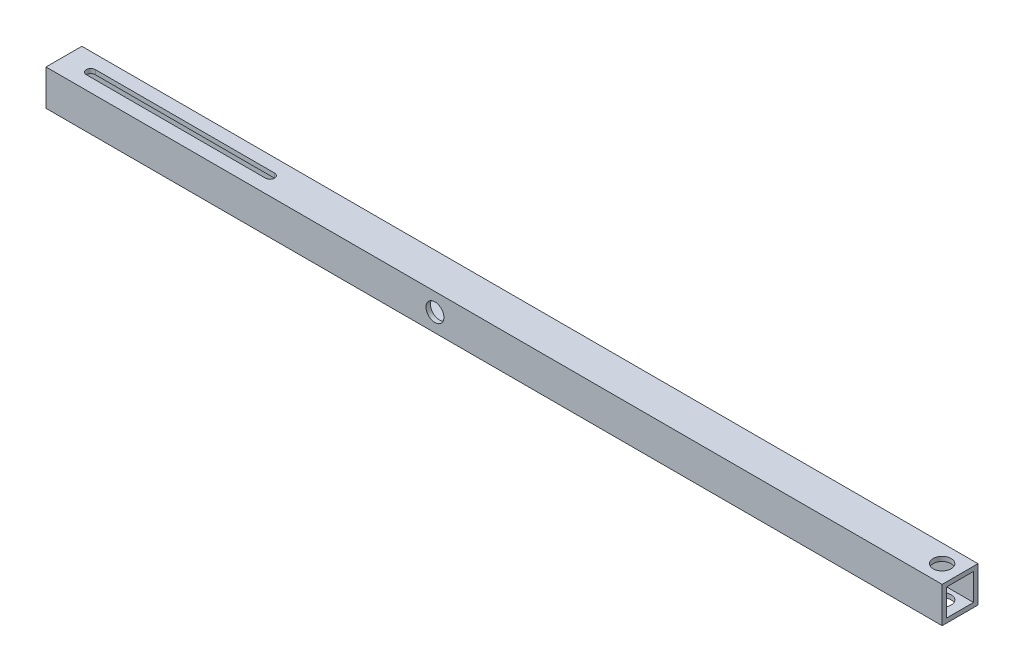
ISO-10303-21;
HEADER;
FILE_DESCRIPTION(('STEP AP214'),'2;1');
FILE_NAME('part.step','',(''),(''),'','','');
FILE_SCHEMA(('AUTOMOTIVE_DESIGN { 1 0 10303 214 1 1 1 1 }'));
ENDSEC;
DATA;
#1=APPLICATION_CONTEXT('core data for automotive mechanical design processes');
#2=APPLICATION_PROTOCOL_DEFINITION('international standard','automotive_design',2000,#1);
#3=PRODUCT_CONTEXT('',#1,'mechanical');
#4=PRODUCT('Part','Part','',(#3));
#5=PRODUCT_RELATED_PRODUCT_CATEGORY('part','',(#4));
#6=PRODUCT_DEFINITION_FORMATION('','',#4);
#7=PRODUCT_DEFINITION_CONTEXT('part definition',#1,'design');
#8=PRODUCT_DEFINITION('design','',#6,#7);
#9=PRODUCT_DEFINITION_SHAPE('','',#8);
#10=(LENGTH_UNIT() NAMED_UNIT(*) SI_UNIT(.MILLI.,.METRE.));
#11=(NAMED_UNIT(*) PLANE_ANGLE_UNIT() SI_UNIT($,.RADIAN.));
#12=(NAMED_UNIT(*) SI_UNIT($,.STERADIAN.) SOLID_ANGLE_UNIT());
#13=UNCERTAINTY_MEASURE_WITH_UNIT(LENGTH_MEASURE(1.E-05),#10,'distance_accuracy_value','');
#14=(GEOMETRIC_REPRESENTATION_CONTEXT(3) GLOBAL_UNCERTAINTY_ASSIGNED_CONTEXT((#13)) GLOBAL_UNIT_ASSIGNED_CONTEXT((#10,
#11,#12)) REPRESENTATION_CONTEXT('',''));
#15=CARTESIAN_POINT('',(0.,0.,0.));
#16=DIRECTION('',(0.,0.,1.));
#17=DIRECTION('',(1.,0.,0.));
#18=AXIS2_PLACEMENT_3D('',#15,#16,#17);
#19=CARTESIAN_POINT('',(250.,2.5,-7.5));
#20=DIRECTION('',(0.,0.,-1.));
#21=DIRECTION('',(0.,1.,0.));
#22=AXIS2_PLACEMENT_3D('',#19,#20,#21);
#23=PLANE('',#22);
#24=CARTESIAN_POINT('',(-32.9999999999999,10.,-7.5));
#25=DIRECTION('',(0.,0.,-1.));
#26=DIRECTION('',(0.,1.,0.));
#27=AXIS2_PLACEMENT_3D('',#24,#25,#26);
#28=CIRCLE('',#27,5.);
#29=CARTESIAN_POINT('',(-32.9999999999999,15.,-7.5));
#30=VERTEX_POINT('',#29);
#31=EDGE_CURVE('E295',#30,#30,#28,.F.);
#32=ORIENTED_EDGE('',*,*,#31,.F.);
#33=EDGE_LOOP('',(#32));
#34=FACE_BOUND('',#33,.T.);
#35=DIRECTION('',(0.,1.,0.));
#36=VECTOR('',#35,1.);
#37=CARTESIAN_POINT('',(-115.747808126116,2.5,-7.5));
#38=LINE('',#37,#36);
#39=CARTESIAN_POINT('',(-115.747808126116,2.5,-7.5));
#40=VERTEX_POINT('',#39);
#41=CARTESIAN_POINT('',(-115.747808126116,16.4021270674297,-7.5));
#42=VERTEX_POINT('',#41);
#43=EDGE_CURVE('E12',#40,#42,#38,.T.);
#44=ORIENTED_EDGE('',*,*,#43,.F.);
#45=DIRECTION('',(-1.,0.,0.));
#46=VECTOR('',#45,1.);
#47=CARTESIAN_POINT('',(250.,2.5,-7.5));
#48=LINE('',#47,#46);
#49=CARTESIAN_POINT('',(250.,2.5,-7.5));
#50=VERTEX_POINT('',#49);
#51=EDGE_CURVE('E352',#50,#40,#48,.T.);
#52=ORIENTED_EDGE('',*,*,#51,.F.);
#53=DIRECTION('',(0.,-1.,0.));
#54=VECTOR('',#53,1.);
#55=CARTESIAN_POINT('',(250.,2.5,-7.5));
#56=LINE('',#55,#54);
#57=CARTESIAN_POINT('',(250.,17.5,-7.5));
#58=VERTEX_POINT('',#57);
#59=EDGE_CURVE('E251',#58,#50,#56,.T.);
#60=ORIENTED_EDGE('',*,*,#59,.F.);
#61=DIRECTION('',(-1.,0.,0.));
#62=VECTOR('',#61,1.);
#63=CARTESIAN_POINT('',(250.,17.5,-7.5));
#64=LINE('',#63,#62);
#65=CARTESIAN_POINT('',(-250.,17.5,-7.5));
#66=VERTEX_POINT('',#65);
#67=EDGE_CURVE('E337',#58,#66,#64,.T.);
#68=ORIENTED_EDGE('',*,*,#67,.T.);
#69=DIRECTION('',(0.,-1.,0.));
#70=VECTOR('',#69,1.);
#71=CARTESIAN_POINT('',(-250.,2.5,-7.5));
#72=LINE('',#71,#70);
#73=CARTESIAN_POINT('',(-250.,16.4021270674297,-7.5));
#74=VERTEX_POINT('',#73);
#75=EDGE_CURVE('E267',#66,#74,#72,.T.);
#76=ORIENTED_EDGE('',*,*,#75,.T.);
#77=DIRECTION('',(-1.,0.,0.));
#78=VECTOR('',#77,1.);
#79=CARTESIAN_POINT('',(250.,16.4021270674297,-7.5));
#80=LINE('',#79,#78);
#81=EDGE_CURVE('E57',#42,#74,#80,.T.);
#82=ORIENTED_EDGE('',*,*,#81,.F.);
#83=EDGE_LOOP('',(#44,#52,#60,#68,#76,#82));
#84=FACE_BOUND('',#83,.T.);
#85=ADVANCED_FACE('F48',(#34,#84),#23,.F.);
#86=CARTESIAN_POINT('',(-32.9999999999999,10.,-10.));
#87=DIRECTION('',(0.,0.,1.));
#88=DIRECTION('',(1.,0.,0.));
#89=AXIS2_PLACEMENT_3D('',#86,#87,#88);
#90=CYLINDRICAL_SURFACE('',#89,5.);
#91=CARTESIAN_POINT('',(-32.9999999999999,10.,7.5));
#92=DIRECTION('',(0.,0.,1.));
#93=DIRECTION('',(0.,-1.,0.));
#94=AXIS2_PLACEMENT_3D('',#91,#92,#93);
#95=CIRCLE('',#94,5.);
#96=CARTESIAN_POINT('',(-32.9999999999999,5.,7.5));
#97=VERTEX_POINT('',#96);
#98=EDGE_CURVE('E299',#97,#97,#95,.F.);
#99=ORIENTED_EDGE('',*,*,#98,.T.);
#100=EDGE_LOOP('',(#99));
#101=FACE_BOUND('',#100,.T.);
#102=CARTESIAN_POINT('',(-32.9999999999999,10.,10.));
#103=DIRECTION('',(0.,0.,1.));
#104=DIRECTION('',(1.,0.,0.));
#105=AXIS2_PLACEMENT_3D('',#102,#103,#104);
#106=CIRCLE('',#105,5.);
#107=CARTESIAN_POINT('',(-27.9999999999999,10.,10.));
#108=VERTEX_POINT('',#107);
#109=EDGE_CURVE('E304',#108,#108,#106,.T.);
#110=ORIENTED_EDGE('',*,*,#109,.T.);
#111=EDGE_LOOP('',(#110));
#112=FACE_BOUND('',#111,.T.);
#113=ADVANCED_FACE('F460',(#101,#112),#90,.F.);
#114=CARTESIAN_POINT('',(250.,20.,10.));
#115=DIRECTION('',(-1.,0.,0.));
#116=DIRECTION('',(0.,0.,1.));
#117=AXIS2_PLACEMENT_3D('',#114,#115,#116);
#118=PLANE('',#117);
#119=DIRECTION('',(0.,0.,1.));
#120=VECTOR('',#119,1.);
#121=CARTESIAN_POINT('',(250.,2.5,-7.5));
#122=LINE('',#121,#120);
#123=CARTESIAN_POINT('',(250.,2.5,7.5));
#124=VERTEX_POINT('',#123);
#125=EDGE_CURVE('E255',#50,#124,#122,.T.);
#126=ORIENTED_EDGE('',*,*,#125,.T.);
#127=DIRECTION('',(0.,1.,0.));
#128=VECTOR('',#127,1.);
#129=CARTESIAN_POINT('',(250.,2.5,7.5));
#130=LINE('',#129,#128);
#131=CARTESIAN_POINT('',(250.,17.5,7.5));
#132=VERTEX_POINT('',#131);
#133=EDGE_CURVE('E242',#124,#132,#130,.T.);
#134=ORIENTED_EDGE('',*,*,#133,.T.);
#135=DIRECTION('',(0.,0.,-1.));
#136=VECTOR('',#135,1.);
#137=CARTESIAN_POINT('',(250.,17.5,-7.5));
#138=LINE('',#137,#136);
#139=EDGE_CURVE('E246',#132,#58,#138,.T.);
#140=ORIENTED_EDGE('',*,*,#139,.T.);
#141=ORIENTED_EDGE('',*,*,#59,.T.);
#142=EDGE_LOOP('',(#126,#134,#140,#141));
#143=FACE_BOUND('',#142,.T.);
#144=DIRECTION('',(0.,0.,-1.));
#145=VECTOR('',#144,1.);
#146=CARTESIAN_POINT('',(250.,0.,10.));
#147=LINE('',#146,#145);
#148=CARTESIAN_POINT('',(250.,0.,10.));
#149=VERTEX_POINT('',#148);
#150=CARTESIAN_POINT('',(250.,0.,-10.));
#151=VERTEX_POINT('',#150);
#152=EDGE_CURVE('E390',#149,#151,#147,.T.);
#153=ORIENTED_EDGE('',*,*,#152,.T.);
#154=DIRECTION('',(0.,-1.,0.));
#155=VECTOR('',#154,1.);
#156=CARTESIAN_POINT('',(250.,20.,-10.));
#157=LINE('',#156,#155);
#158=CARTESIAN_POINT('',(250.,20.,-10.));
#159=VERTEX_POINT('',#158);
#160=EDGE_CURVE('E288',#159,#151,#157,.T.);
#161=ORIENTED_EDGE('',*,*,#160,.F.);
#162=DIRECTION('',(0.,0.,-1.));
#163=VECTOR('',#162,1.);
#164=CARTESIAN_POINT('',(250.,20.,10.));
#165=LINE('',#164,#163);
#166=CARTESIAN_POINT('',(250.,20.,10.));
#167=VERTEX_POINT('',#166);
#168=EDGE_CURVE('E415',#167,#159,#165,.T.);
#169=ORIENTED_EDGE('',*,*,#168,.F.);
#170=DIRECTION('',(0.,-1.,0.));
#171=VECTOR('',#170,1.);
#172=CARTESIAN_POINT('',(250.,20.,10.));
#173=LINE('',#172,#171);
#174=EDGE_CURVE('E416',#167,#149,#173,.T.);
#175=ORIENTED_EDGE('',*,*,#174,.T.);
#176=EDGE_LOOP('',(#153,#161,#169,#175));
#177=FACE_BOUND('',#176,.T.);
#178=ADVANCED_FACE('F50',(#143,#177),#118,.F.);
#179=CARTESIAN_POINT('',(-250.,20.,-10.));
#180=DIRECTION('',(0.,0.,1.));
#181=DIRECTION('',(1.,0.,0.));
#182=AXIS2_PLACEMENT_3D('',#179,#180,#181);
#183=PLANE('',#182);
#184=CARTESIAN_POINT('',(-32.9999999999999,10.,-10.));
#185=DIRECTION('',(0.,0.,1.));
#186=DIRECTION('',(1.,0.,0.));
#187=AXIS2_PLACEMENT_3D('',#184,#185,#186);
#188=CIRCLE('',#187,5.);
#189=CARTESIAN_POINT('',(-27.9999999999999,10.,-10.));
#190=VERTEX_POINT('',#189);
#191=EDGE_CURVE('E398',#190,#190,#188,.T.);
#192=ORIENTED_EDGE('',*,*,#191,.T.);
#193=EDGE_LOOP('',(#192));
#194=FACE_BOUND('',#193,.T.);
#195=DIRECTION('',(-1.,0.,0.));
#196=VECTOR('',#195,1.);
#197=CARTESIAN_POINT('',(-250.,0.,-10.));
#198=LINE('',#197,#196);
#199=CARTESIAN_POINT('',(-250.,0.,-10.));
#200=VERTEX_POINT('',#199);
#201=EDGE_CURVE('E393',#151,#200,#198,.T.);
#202=ORIENTED_EDGE('',*,*,#201,.T.);
#203=DIRECTION('',(0.,-1.,0.));
#204=VECTOR('',#203,1.);
#205=CARTESIAN_POINT('',(-250.,20.,-10.));
#206=LINE('',#205,#204);
#207=CARTESIAN_POINT('',(-250.,20.,-10.));
#208=VERTEX_POINT('',#207);
#209=EDGE_CURVE('E282',#208,#200,#206,.T.);
#210=ORIENTED_EDGE('',*,*,#209,.F.);
#211=DIRECTION('',(-1.,0.,0.));
#212=VECTOR('',#211,1.);
#213=CARTESIAN_POINT('',(-250.,20.,-10.));
#214=LINE('',#213,#212);
#215=EDGE_CURVE('E430',#159,#208,#214,.T.);
#216=ORIENTED_EDGE('',*,*,#215,.F.);
#217=ORIENTED_EDGE('',*,*,#160,.T.);
#218=EDGE_LOOP('',(#202,#210,#216,#217));
#219=FACE_BOUND('',#218,.T.);
#220=ADVANCED_FACE('F448',(#194,#219),#183,.F.);
#221=CARTESIAN_POINT('',(-250.,20.,10.));
#222=DIRECTION('',(1.,0.,0.));
#223=DIRECTION('',(0.,0.,-1.));
#224=AXIS2_PLACEMENT_3D('',#221,#222,#223);
#225=PLANE('',#224);
#226=DIRECTION('',(0.,0.,-1.));
#227=VECTOR('',#226,1.);
#228=CARTESIAN_POINT('',(-250.,17.5,-7.5));
#229=LINE('',#228,#227);
#230=CARTESIAN_POINT('',(-250.,17.5,7.5));
#231=VERTEX_POINT('',#230);
#232=EDGE_CURVE('E262',#231,#66,#229,.T.);
#233=ORIENTED_EDGE('',*,*,#232,.F.);
#234=DIRECTION('',(0.,1.,0.));
#235=VECTOR('',#234,1.);
#236=CARTESIAN_POINT('',(-250.,2.5,7.5));
#237=LINE('',#236,#235);
#238=CARTESIAN_POINT('',(-250.,2.5,7.5));
#239=VERTEX_POINT('',#238);
#240=EDGE_CURVE('E241',#239,#231,#237,.T.);
#241=ORIENTED_EDGE('',*,*,#240,.F.);
#242=DIRECTION('',(0.,0.,1.));
#243=VECTOR('',#242,1.);
#244=CARTESIAN_POINT('',(-250.,2.5,-7.5));
#245=LINE('',#244,#243);
#246=CARTESIAN_POINT('',(-250.,2.5,-7.5));
#247=VERTEX_POINT('',#246);
#248=EDGE_CURVE('E247',#247,#239,#245,.T.);
#249=ORIENTED_EDGE('',*,*,#248,.F.);
#250=EDGE_CURVE('E266',#74,#247,#72,.T.);
#251=ORIENTED_EDGE('',*,*,#250,.F.);
#252=ORIENTED_EDGE('',*,*,#75,.F.);
#253=EDGE_LOOP('',(#233,#241,#249,#251,#252));
#254=FACE_BOUND('',#253,.T.);
#255=DIRECTION('',(0.,0.,1.));
#256=VECTOR('',#255,1.);
#257=CARTESIAN_POINT('',(-250.,0.,10.));
#258=LINE('',#257,#256);
#259=CARTESIAN_POINT('',(-250.,0.,10.));
#260=VERTEX_POINT('',#259);
#261=EDGE_CURVE('E402',#200,#260,#258,.T.);
#262=ORIENTED_EDGE('',*,*,#261,.T.);
#263=DIRECTION('',(0.,-1.,0.));
#264=VECTOR('',#263,1.);
#265=CARTESIAN_POINT('',(-250.,20.,10.));
#266=LINE('',#265,#264);
#267=CARTESIAN_POINT('',(-250.,20.,10.));
#268=VERTEX_POINT('',#267);
#269=EDGE_CURVE('E289',#268,#260,#266,.T.);
#270=ORIENTED_EDGE('',*,*,#269,.F.);
#271=DIRECTION('',(0.,0.,1.));
#272=VECTOR('',#271,1.);
#273=CARTESIAN_POINT('',(-250.,20.,10.));
#274=LINE('',#273,#272);
#275=EDGE_CURVE('E433',#208,#268,#274,.T.);
#276=ORIENTED_EDGE('',*,*,#275,.F.);
#277=ORIENTED_EDGE('',*,*,#209,.T.);
#278=EDGE_LOOP('',(#262,#270,#276,#277));
#279=FACE_BOUND('',#278,.T.);
#280=ADVANCED_FACE('F331',(#254,#279),#225,.F.);
#281=CARTESIAN_POINT('',(-250.,20.,10.));
#282=DIRECTION('',(0.,0.,-1.));
#283=DIRECTION('',(-1.,0.,0.));
#284=AXIS2_PLACEMENT_3D('',#281,#282,#283);
#285=PLANE('',#284);
#286=ORIENTED_EDGE('',*,*,#109,.F.);
#287=EDGE_LOOP('',(#286));
#288=FACE_BOUND('',#287,.T.);
#289=DIRECTION('',(1.,0.,0.));
#290=VECTOR('',#289,1.);
#291=CARTESIAN_POINT('',(-250.,0.,10.));
#292=LINE('',#291,#290);
#293=EDGE_CURVE('E392',#260,#149,#292,.T.);
#294=ORIENTED_EDGE('',*,*,#293,.T.);
#295=ORIENTED_EDGE('',*,*,#174,.F.);
#296=DIRECTION('',(1.,0.,0.));
#297=VECTOR('',#296,1.);
#298=CARTESIAN_POINT('',(-250.,20.,10.));
#299=LINE('',#298,#297);
#300=EDGE_CURVE('E407',#268,#167,#299,.T.);
#301=ORIENTED_EDGE('',*,*,#300,.F.);
#302=ORIENTED_EDGE('',*,*,#269,.T.);
#303=EDGE_LOOP('',(#294,#295,#301,#302));
#304=FACE_BOUND('',#303,.T.);
#305=ADVANCED_FACE('F445',(#288,#304),#285,.F.);
#306=CARTESIAN_POINT('',(0.,20.,0.));
#307=DIRECTION('',(0.,-1.,0.));
#308=DIRECTION('',(0.,0.,-1.));
#309=AXIS2_PLACEMENT_3D('',#306,#307,#308);
#310=PLANE('',#309);
#311=CARTESIAN_POINT('',(240.,20.,0.));
#312=DIRECTION('',(0.,1.,0.));
#313=DIRECTION('',(0.,0.,1.));
#314=AXIS2_PLACEMENT_3D('',#311,#312,#313);
#315=CIRCLE('',#314,4.99999999999999);
#316=CARTESIAN_POINT('',(240.,20.,4.99999999999999));
#317=VERTEX_POINT('',#316);
#318=EDGE_CURVE('E501',#317,#317,#315,.T.);
#319=ORIENTED_EDGE('',*,*,#318,.F.);
#320=EDGE_LOOP('',(#319));
#321=FACE_BOUND('',#320,.T.);
#322=DIRECTION('',(1.,0.,0.));
#323=VECTOR('',#322,1.);
#324=CARTESIAN_POINT('',(-235.,20.,2.5));
#325=LINE('',#324,#323);
#326=CARTESIAN_POINT('',(-235.,20.,2.5));
#327=VERTEX_POINT('',#326);
#328=CARTESIAN_POINT('',(-135.,20.,2.5));
#329=VERTEX_POINT('',#328);
#330=EDGE_CURVE('E183',#327,#329,#325,.T.);
#331=ORIENTED_EDGE('',*,*,#330,.F.);
#332=CARTESIAN_POINT('',(-235.,20.,0.));
#333=DIRECTION('',(0.,1.,0.));
#334=DIRECTION('',(0.,0.,1.));
#335=AXIS2_PLACEMENT_3D('',#332,#333,#334);
#336=CIRCLE('',#335,2.5);
#337=CARTESIAN_POINT('',(-235.,20.,-2.5));
#338=VERTEX_POINT('',#337);
#339=EDGE_CURVE('E190',#338,#327,#336,.T.);
#340=ORIENTED_EDGE('',*,*,#339,.F.);
#341=DIRECTION('',(-1.,0.,0.));
#342=VECTOR('',#341,1.);
#343=CARTESIAN_POINT('',(-235.,20.,-2.5));
#344=LINE('',#343,#342);
#345=CARTESIAN_POINT('',(-135.,20.,-2.5));
#346=VERTEX_POINT('',#345);
#347=EDGE_CURVE('E194',#346,#338,#344,.T.);
#348=ORIENTED_EDGE('',*,*,#347,.F.);
#349=CARTESIAN_POINT('',(-135.,20.,0.));
#350=DIRECTION('',(0.,1.,0.));
#351=DIRECTION('',(0.,0.,1.));
#352=AXIS2_PLACEMENT_3D('',#349,#350,#351);
#353=CIRCLE('',#352,2.5);
#354=EDGE_CURVE('E171',#329,#346,#353,.T.);
#355=ORIENTED_EDGE('',*,*,#354,.F.);
#356=EDGE_LOOP('',(#331,#340,#348,#355));
#357=FACE_BOUND('',#356,.T.);
#358=ORIENTED_EDGE('',*,*,#168,.T.);
#359=ORIENTED_EDGE('',*,*,#215,.T.);
#360=ORIENTED_EDGE('',*,*,#275,.T.);
#361=ORIENTED_EDGE('',*,*,#300,.T.);
#362=EDGE_LOOP('',(#358,#359,#360,#361));
#363=FACE_BOUND('',#362,.T.);
#364=ADVANCED_FACE('F191',(#321,#357,#363),#310,.F.);
#365=CARTESIAN_POINT('',(0.,0.,0.));
#366=DIRECTION('',(0.,-1.,0.));
#367=DIRECTION('',(0.,0.,-1.));
#368=AXIS2_PLACEMENT_3D('',#365,#366,#367);
#369=PLANE('',#368);
#370=CARTESIAN_POINT('',(240.,0.,0.));
#371=DIRECTION('',(0.,1.,0.));
#372=DIRECTION('',(0.,0.,1.));
#373=AXIS2_PLACEMENT_3D('',#370,#371,#372);
#374=CIRCLE('',#373,4.99999999999999);
#375=CARTESIAN_POINT('',(240.,0.,4.99999999999999));
#376=VERTEX_POINT('',#375);
#377=EDGE_CURVE('E321',#376,#376,#374,.T.);
#378=ORIENTED_EDGE('',*,*,#377,.T.);
#379=EDGE_LOOP('',(#378));
#380=FACE_BOUND('',#379,.T.);
#381=CARTESIAN_POINT('',(-235.,0.,0.));
#382=DIRECTION('',(0.,-1.,0.));
#383=DIRECTION('',(0.,0.,-1.));
#384=AXIS2_PLACEMENT_3D('',#381,#382,#383);
#385=CIRCLE('',#384,2.5);
#386=CARTESIAN_POINT('',(-235.,0.,2.5));
#387=VERTEX_POINT('',#386);
#388=CARTESIAN_POINT('',(-235.,0.,-2.5));
#389=VERTEX_POINT('',#388);
#390=EDGE_CURVE('E238',#387,#389,#385,.T.);
#391=ORIENTED_EDGE('',*,*,#390,.F.);
#392=DIRECTION('',(-1.,0.,0.));
#393=VECTOR('',#392,1.);
#394=CARTESIAN_POINT('',(0.,0.,2.5));
#395=LINE('',#394,#393);
#396=CARTESIAN_POINT('',(-135.,0.,2.5));
#397=VERTEX_POINT('',#396);
#398=EDGE_CURVE('E216',#397,#387,#395,.T.);
#399=ORIENTED_EDGE('',*,*,#398,.F.);
#400=CARTESIAN_POINT('',(-135.,0.,0.));
#401=DIRECTION('',(0.,-1.,0.));
#402=DIRECTION('',(0.,0.,-1.));
#403=AXIS2_PLACEMENT_3D('',#400,#401,#402);
#404=CIRCLE('',#403,2.5);
#405=CARTESIAN_POINT('',(-135.,0.,-2.5));
#406=VERTEX_POINT('',#405);
#407=EDGE_CURVE('E223',#406,#397,#404,.T.);
#408=ORIENTED_EDGE('',*,*,#407,.F.);
#409=DIRECTION('',(1.,0.,0.));
#410=VECTOR('',#409,1.);
#411=CARTESIAN_POINT('',(0.,0.,-2.5));
#412=LINE('',#411,#410);
#413=EDGE_CURVE('E231',#389,#406,#412,.T.);
#414=ORIENTED_EDGE('',*,*,#413,.F.);
#415=EDGE_LOOP('',(#391,#399,#408,#414));
#416=FACE_BOUND('',#415,.T.);
#417=ORIENTED_EDGE('',*,*,#152,.F.);
#418=ORIENTED_EDGE('',*,*,#293,.F.);
#419=ORIENTED_EDGE('',*,*,#261,.F.);
#420=ORIENTED_EDGE('',*,*,#201,.F.);
#421=EDGE_LOOP('',(#417,#418,#419,#420));
#422=FACE_BOUND('',#421,.T.);
#423=ADVANCED_FACE('F381',(#380,#416,#422),#369,.T.);
#424=ORIENTED_EDGE('',*,*,#31,.T.);
#425=EDGE_LOOP('',(#424));
#426=FACE_BOUND('',#425,.T.);
#427=ORIENTED_EDGE('',*,*,#191,.F.);
#428=EDGE_LOOP('',(#427));
#429=FACE_BOUND('',#428,.T.);
#430=ADVANCED_FACE('F384',(#426,#429),#90,.F.);
#431=CARTESIAN_POINT('',(250.,2.5,7.5));
#432=DIRECTION('',(0.,0.,1.));
#433=DIRECTION('',(0.,-1.,0.));
#434=AXIS2_PLACEMENT_3D('',#431,#432,#433);
#435=PLANE('',#434);
#436=ORIENTED_EDGE('',*,*,#240,.T.);
#437=DIRECTION('',(-1.,0.,0.));
#438=VECTOR('',#437,1.);
#439=CARTESIAN_POINT('',(250.,17.5,7.5));
#440=LINE('',#439,#438);
#441=EDGE_CURVE('E259',#132,#231,#440,.T.);
#442=ORIENTED_EDGE('',*,*,#441,.F.);
#443=ORIENTED_EDGE('',*,*,#133,.F.);
#444=DIRECTION('',(-1.,0.,0.));
#445=VECTOR('',#444,1.);
#446=CARTESIAN_POINT('',(250.,2.5,7.5));
#447=LINE('',#446,#445);
#448=EDGE_CURVE('E300',#124,#239,#447,.T.);
#449=ORIENTED_EDGE('',*,*,#448,.T.);
#450=EDGE_LOOP('',(#436,#442,#443,#449));
#451=FACE_BOUND('',#450,.T.);
#452=ORIENTED_EDGE('',*,*,#98,.F.);
#453=EDGE_LOOP('',(#452));
#454=FACE_BOUND('',#453,.T.);
#455=ADVANCED_FACE('F346',(#451,#454),#435,.F.);
#456=EDGE_CURVE('E341',#40,#247,#48,.T.);
#457=ORIENTED_EDGE('',*,*,#456,.F.);
#458=ORIENTED_EDGE('',*,*,#43,.T.);
#459=ORIENTED_EDGE('',*,*,#81,.T.);
#460=ORIENTED_EDGE('',*,*,#250,.T.);
#461=EDGE_LOOP('',(#457,#458,#459,#460));
#462=FACE_BOUND('',#461,.T.);
#463=ADVANCED_FACE('F326',(#462),#23,.F.);
#464=CARTESIAN_POINT('',(250.,2.5,-7.5));
#465=DIRECTION('',(0.,-1.,0.));
#466=DIRECTION('',(0.,0.,-1.));
#467=AXIS2_PLACEMENT_3D('',#464,#465,#466);
#468=PLANE('',#467);
#469=CARTESIAN_POINT('',(240.,2.5,0.));
#470=DIRECTION('',(0.,-1.,0.));
#471=DIRECTION('',(0.,0.,-1.));
#472=AXIS2_PLACEMENT_3D('',#469,#470,#471);
#473=CIRCLE('',#472,4.99999999999999);
#474=CARTESIAN_POINT('',(240.,2.5,-4.99999999999999));
#475=VERTEX_POINT('',#474);
#476=EDGE_CURVE('E320',#475,#475,#473,.T.);
#477=ORIENTED_EDGE('',*,*,#476,.T.);
#478=EDGE_LOOP('',(#477));
#479=FACE_BOUND('',#478,.T.);
#480=DIRECTION('',(-1.,0.,0.));
#481=VECTOR('',#480,1.);
#482=CARTESIAN_POINT('',(250.,2.5,2.5));
#483=LINE('',#482,#481);
#484=CARTESIAN_POINT('',(-135.,2.5,2.5));
#485=VERTEX_POINT('',#484);
#486=CARTESIAN_POINT('',(-235.,2.5,2.5));
#487=VERTEX_POINT('',#486);
#488=EDGE_CURVE('E212',#485,#487,#483,.T.);
#489=ORIENTED_EDGE('',*,*,#488,.T.);
#490=CARTESIAN_POINT('',(-235.,2.5,0.));
#491=DIRECTION('',(0.,-1.,0.));
#492=DIRECTION('',(0.,0.,-1.));
#493=AXIS2_PLACEMENT_3D('',#490,#491,#492);
#494=CIRCLE('',#493,2.5);
#495=CARTESIAN_POINT('',(-235.,2.5,-2.5));
#496=VERTEX_POINT('',#495);
#497=EDGE_CURVE('E234',#487,#496,#494,.T.);
#498=ORIENTED_EDGE('',*,*,#497,.T.);
#499=DIRECTION('',(1.,0.,0.));
#500=VECTOR('',#499,1.);
#501=CARTESIAN_POINT('',(250.,2.5,-2.5));
#502=LINE('',#501,#500);
#503=CARTESIAN_POINT('',(-135.,2.5,-2.5));
#504=VERTEX_POINT('',#503);
#505=EDGE_CURVE('E227',#496,#504,#502,.T.);
#506=ORIENTED_EDGE('',*,*,#505,.T.);
#507=CARTESIAN_POINT('',(-135.,2.5,0.));
#508=DIRECTION('',(0.,-1.,0.));
#509=DIRECTION('',(0.,0.,-1.));
#510=AXIS2_PLACEMENT_3D('',#507,#508,#509);
#511=CIRCLE('',#510,2.5);
#512=EDGE_CURVE('E219',#504,#485,#511,.T.);
#513=ORIENTED_EDGE('',*,*,#512,.T.);
#514=EDGE_LOOP('',(#489,#498,#506,#513));
#515=FACE_BOUND('',#514,.T.);
#516=ORIENTED_EDGE('',*,*,#248,.T.);
#517=ORIENTED_EDGE('',*,*,#448,.F.);
#518=ORIENTED_EDGE('',*,*,#125,.F.);
#519=ORIENTED_EDGE('',*,*,#51,.T.);
#520=ORIENTED_EDGE('',*,*,#456,.T.);
#521=EDGE_LOOP('',(#516,#517,#518,#519,#520));
#522=FACE_BOUND('',#521,.T.);
#523=ADVANCED_FACE('F353',(#479,#515,#522),#468,.F.);
#524=CARTESIAN_POINT('',(250.,17.5,-7.5));
#525=DIRECTION('',(0.,1.,0.));
#526=DIRECTION('',(0.,0.,1.));
#527=AXIS2_PLACEMENT_3D('',#524,#525,#526);
#528=PLANE('',#527);
#529=CARTESIAN_POINT('',(240.,17.5,0.));
#530=DIRECTION('',(0.,1.,0.));
#531=DIRECTION('',(0.,0.,1.));
#532=AXIS2_PLACEMENT_3D('',#529,#530,#531);
#533=CIRCLE('',#532,4.99999999999999);
#534=CARTESIAN_POINT('',(240.,17.5,4.99999999999999));
#535=VERTEX_POINT('',#534);
#536=EDGE_CURVE('E317',#535,#535,#533,.T.);
#537=ORIENTED_EDGE('',*,*,#536,.T.);
#538=EDGE_LOOP('',(#537));
#539=FACE_BOUND('',#538,.T.);
#540=DIRECTION('',(-1.,0.,0.));
#541=VECTOR('',#540,1.);
#542=CARTESIAN_POINT('',(250.,17.5,-2.5));
#543=LINE('',#542,#541);
#544=CARTESIAN_POINT('',(-135.,17.5,-2.5));
#545=VERTEX_POINT('',#544);
#546=CARTESIAN_POINT('',(-235.,17.5,-2.5));
#547=VERTEX_POINT('',#546);
#548=EDGE_CURVE('E309',#545,#547,#543,.T.);
#549=ORIENTED_EDGE('',*,*,#548,.T.);
#550=CARTESIAN_POINT('',(-235.,17.5,0.));
#551=DIRECTION('',(0.,1.,0.));
#552=DIRECTION('',(0.,0.,1.));
#553=AXIS2_PLACEMENT_3D('',#550,#551,#552);
#554=CIRCLE('',#553,2.5);
#555=CARTESIAN_POINT('',(-235.,17.5,2.5));
#556=VERTEX_POINT('',#555);
#557=EDGE_CURVE('E313',#547,#556,#554,.T.);
#558=ORIENTED_EDGE('',*,*,#557,.T.);
#559=DIRECTION('',(1.,0.,0.));
#560=VECTOR('',#559,1.);
#561=CARTESIAN_POINT('',(250.,17.5,2.5));
#562=LINE('',#561,#560);
#563=CARTESIAN_POINT('',(-135.,17.5,2.5));
#564=VERTEX_POINT('',#563);
#565=EDGE_CURVE('E294',#556,#564,#562,.T.);
#566=ORIENTED_EDGE('',*,*,#565,.T.);
#567=CARTESIAN_POINT('',(-135.,17.5,0.));
#568=DIRECTION('',(0.,1.,0.));
#569=DIRECTION('',(0.,0.,1.));
#570=AXIS2_PLACEMENT_3D('',#567,#568,#569);
#571=CIRCLE('',#570,2.5);
#572=EDGE_CURVE('E174',#564,#545,#571,.T.);
#573=ORIENTED_EDGE('',*,*,#572,.T.);
#574=EDGE_LOOP('',(#549,#558,#566,#573));
#575=FACE_BOUND('',#574,.T.);
#576=ORIENTED_EDGE('',*,*,#232,.T.);
#577=ORIENTED_EDGE('',*,*,#67,.F.);
#578=ORIENTED_EDGE('',*,*,#139,.F.);
#579=ORIENTED_EDGE('',*,*,#441,.T.);
#580=EDGE_LOOP('',(#576,#577,#578,#579));
#581=FACE_BOUND('',#580,.T.);
#582=ADVANCED_FACE('F344',(#539,#575,#581),#528,.F.);
#583=CARTESIAN_POINT('',(-235.,-80.,2.5));
#584=DIRECTION('',(0.,0.,1.));
#585=DIRECTION('',(1.,0.,0.));
#586=AXIS2_PLACEMENT_3D('',#583,#584,#585);
#587=PLANE('',#586);
#588=DIRECTION('',(0.,1.,0.));
#589=VECTOR('',#588,1.);
#590=CARTESIAN_POINT('',(-235.,-80.,2.5));
#591=LINE('',#590,#589);
#592=EDGE_CURVE('E186',#556,#327,#591,.T.);
#593=ORIENTED_EDGE('',*,*,#592,.T.);
#594=ORIENTED_EDGE('',*,*,#330,.T.);
#595=DIRECTION('',(0.,1.,0.));
#596=VECTOR('',#595,1.);
#597=CARTESIAN_POINT('',(-135.,-80.,2.5));
#598=LINE('',#597,#596);
#599=EDGE_CURVE('E166',#564,#329,#598,.T.);
#600=ORIENTED_EDGE('',*,*,#599,.F.);
#601=ORIENTED_EDGE('',*,*,#565,.F.);
#602=EDGE_LOOP('',(#593,#594,#600,#601));
#603=FACE_BOUND('',#602,.T.);
#604=ADVANCED_FACE('F184',(#603),#587,.F.);
#605=CARTESIAN_POINT('',(-135.,-80.,0.));
#606=DIRECTION('',(0.,1.,0.));
#607=DIRECTION('',(0.,0.,1.));
#608=AXIS2_PLACEMENT_3D('',#605,#606,#607);
#609=CYLINDRICAL_SURFACE('',#608,2.5);
#610=ORIENTED_EDGE('',*,*,#599,.T.);
#611=ORIENTED_EDGE('',*,*,#354,.T.);
#612=DIRECTION('',(0.,1.,0.));
#613=VECTOR('',#612,1.);
#614=CARTESIAN_POINT('',(-135.,-80.,-2.5));
#615=LINE('',#614,#613);
#616=EDGE_CURVE('E207',#545,#346,#615,.T.);
#617=ORIENTED_EDGE('',*,*,#616,.F.);
#618=ORIENTED_EDGE('',*,*,#572,.F.);
#619=EDGE_LOOP('',(#610,#611,#617,#618));
#620=FACE_BOUND('',#619,.T.);
#621=ADVANCED_FACE('F168',(#620),#609,.F.);
#622=CARTESIAN_POINT('',(-235.,-80.,-2.5));
#623=DIRECTION('',(0.,0.,-1.));
#624=DIRECTION('',(-1.,0.,0.));
#625=AXIS2_PLACEMENT_3D('',#622,#623,#624);
#626=PLANE('',#625);
#627=ORIENTED_EDGE('',*,*,#616,.T.);
#628=ORIENTED_EDGE('',*,*,#347,.T.);
#629=DIRECTION('',(0.,1.,0.));
#630=VECTOR('',#629,1.);
#631=CARTESIAN_POINT('',(-235.,-80.,-2.5));
#632=LINE('',#631,#630);
#633=EDGE_CURVE('E202',#547,#338,#632,.T.);
#634=ORIENTED_EDGE('',*,*,#633,.F.);
#635=ORIENTED_EDGE('',*,*,#548,.F.);
#636=EDGE_LOOP('',(#627,#628,#634,#635));
#637=FACE_BOUND('',#636,.T.);
#638=ADVANCED_FACE('F493',(#637),#626,.F.);
#639=CARTESIAN_POINT('',(-235.,-80.,0.));
#640=DIRECTION('',(0.,1.,0.));
#641=DIRECTION('',(0.,0.,1.));
#642=AXIS2_PLACEMENT_3D('',#639,#640,#641);
#643=CYLINDRICAL_SURFACE('',#642,2.5);
#644=ORIENTED_EDGE('',*,*,#633,.T.);
#645=ORIENTED_EDGE('',*,*,#339,.T.);
#646=ORIENTED_EDGE('',*,*,#592,.F.);
#647=ORIENTED_EDGE('',*,*,#557,.F.);
#648=EDGE_LOOP('',(#644,#645,#646,#647));
#649=FACE_BOUND('',#648,.T.);
#650=ADVANCED_FACE('F495',(#649),#643,.F.);
#651=ORIENTED_EDGE('',*,*,#390,.T.);
#652=EDGE_CURVE('E205',#389,#496,#632,.T.);
#653=ORIENTED_EDGE('',*,*,#652,.T.);
#654=ORIENTED_EDGE('',*,*,#497,.F.);
#655=EDGE_CURVE('E179',#387,#487,#591,.T.);
#656=ORIENTED_EDGE('',*,*,#655,.F.);
#657=EDGE_LOOP('',(#651,#653,#654,#656));
#658=FACE_BOUND('',#657,.T.);
#659=ADVANCED_FACE('F370',(#658),#643,.F.);
#660=ORIENTED_EDGE('',*,*,#413,.T.);
#661=EDGE_CURVE('E206',#406,#504,#615,.T.);
#662=ORIENTED_EDGE('',*,*,#661,.T.);
#663=ORIENTED_EDGE('',*,*,#505,.F.);
#664=ORIENTED_EDGE('',*,*,#652,.F.);
#665=EDGE_LOOP('',(#660,#662,#663,#664));
#666=FACE_BOUND('',#665,.T.);
#667=ADVANCED_FACE('F378',(#666),#626,.F.);
#668=ORIENTED_EDGE('',*,*,#407,.T.);
#669=EDGE_CURVE('E178',#397,#485,#598,.T.);
#670=ORIENTED_EDGE('',*,*,#669,.T.);
#671=ORIENTED_EDGE('',*,*,#512,.F.);
#672=ORIENTED_EDGE('',*,*,#661,.F.);
#673=EDGE_LOOP('',(#668,#670,#671,#672));
#674=FACE_BOUND('',#673,.T.);
#675=ADVANCED_FACE('F375',(#674),#609,.F.);
#676=ORIENTED_EDGE('',*,*,#398,.T.);
#677=ORIENTED_EDGE('',*,*,#655,.T.);
#678=ORIENTED_EDGE('',*,*,#488,.F.);
#679=ORIENTED_EDGE('',*,*,#669,.F.);
#680=EDGE_LOOP('',(#676,#677,#678,#679));
#681=FACE_BOUND('',#680,.T.);
#682=ADVANCED_FACE('F366',(#681),#587,.F.);
#683=CARTESIAN_POINT('',(240.,0.,0.));
#684=DIRECTION('',(0.,1.,0.));
#685=DIRECTION('',(0.,0.,1.));
#686=AXIS2_PLACEMENT_3D('',#683,#684,#685);
#687=CYLINDRICAL_SURFACE('',#686,4.99999999999999);
#688=ORIENTED_EDGE('',*,*,#318,.T.);
#689=EDGE_LOOP('',(#688));
#690=FACE_BOUND('',#689,.T.);
#691=ORIENTED_EDGE('',*,*,#536,.F.);
#692=EDGE_LOOP('',(#691));
#693=FACE_BOUND('',#692,.T.);
#694=ADVANCED_FACE('F515',(#690,#693),#687,.F.);
#695=ORIENTED_EDGE('',*,*,#377,.F.);
#696=EDGE_LOOP('',(#695));
#697=FACE_BOUND('',#696,.T.);
#698=ORIENTED_EDGE('',*,*,#476,.F.);
#699=EDGE_LOOP('',(#698));
#700=FACE_BOUND('',#699,.T.);
#701=ADVANCED_FACE('F512',(#697,#700),#687,.F.);
#702=CLOSED_SHELL('',(#85,#113,#178,#220,#280,#305,#364,#423,#430,#455,#463,#523,#582,#604,#621,
#638,#650,#659,#667,#675,#682,#694,#701));
#703=MANIFOLD_SOLID_BREP('B2',#702);
#704=ADVANCED_BREP_SHAPE_REPRESENTATION('',(#18,#703),#14);
#705=SHAPE_DEFINITION_REPRESENTATION(#9,#704);
ENDSEC;
END-ISO-10303-21;
